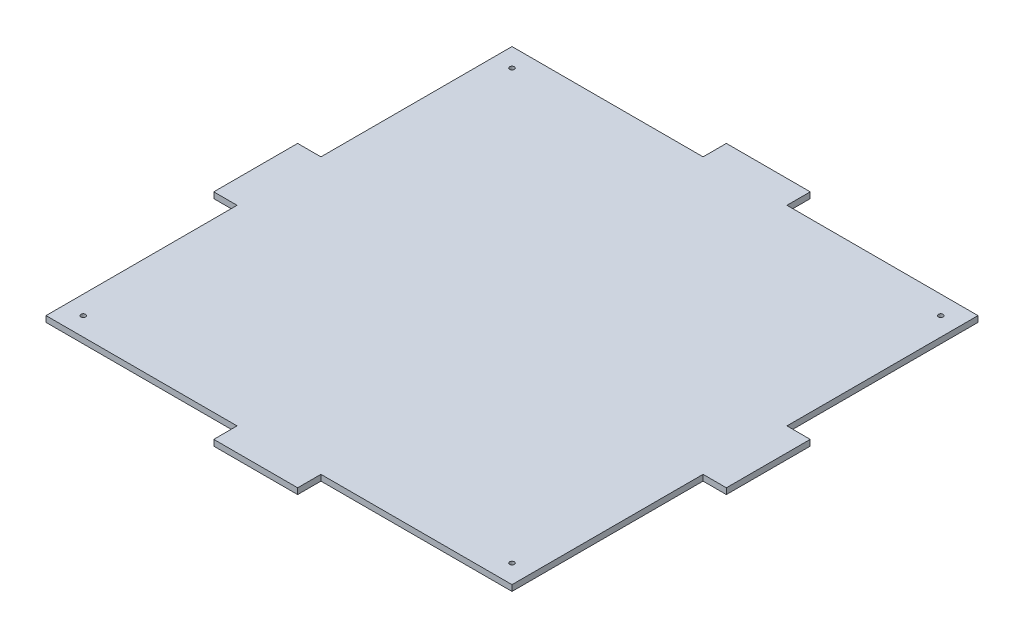
ISO-10303-21;
HEADER;
FILE_DESCRIPTION(('STEP AP214'),'2;1');
FILE_NAME('part.step','',(''),(''),'','','');
FILE_SCHEMA(('AUTOMOTIVE_DESIGN { 1 0 10303 214 1 1 1 1 }'));
ENDSEC;
DATA;
#1=APPLICATION_CONTEXT('core data for automotive mechanical design processes');
#2=APPLICATION_PROTOCOL_DEFINITION('international standard','automotive_design',2000,#1);
#3=PRODUCT_CONTEXT('',#1,'mechanical');
#4=PRODUCT('Part','Part','',(#3));
#5=PRODUCT_RELATED_PRODUCT_CATEGORY('part','',(#4));
#6=PRODUCT_DEFINITION_FORMATION('','',#4);
#7=PRODUCT_DEFINITION_CONTEXT('part definition',#1,'design');
#8=PRODUCT_DEFINITION('design','',#6,#7);
#9=PRODUCT_DEFINITION_SHAPE('','',#8);
#10=(LENGTH_UNIT() NAMED_UNIT(*) SI_UNIT(.MILLI.,.METRE.));
#11=(NAMED_UNIT(*) PLANE_ANGLE_UNIT() SI_UNIT($,.RADIAN.));
#12=(NAMED_UNIT(*) SI_UNIT($,.STERADIAN.) SOLID_ANGLE_UNIT());
#13=UNCERTAINTY_MEASURE_WITH_UNIT(LENGTH_MEASURE(1.E-05),#10,'distance_accuracy_value','');
#14=(GEOMETRIC_REPRESENTATION_CONTEXT(3) GLOBAL_UNCERTAINTY_ASSIGNED_CONTEXT((#13)) GLOBAL_UNIT_ASSIGNED_CONTEXT((#10,
#11,#12)) REPRESENTATION_CONTEXT('',''));
#15=CARTESIAN_POINT('',(0.,0.,0.));
#16=DIRECTION('',(0.,0.,1.));
#17=DIRECTION('',(1.,0.,0.));
#18=AXIS2_PLACEMENT_3D('',#15,#16,#17);
#19=CARTESIAN_POINT('',(0.,3.175,0.));
#20=DIRECTION('',(0.,-1.,0.));
#21=DIRECTION('',(0.,0.,-1.));
#22=AXIS2_PLACEMENT_3D('',#19,#20,#21);
#23=PLANE('',#22);
#24=CARTESIAN_POINT('',(115.,3.175,-115.));
#25=DIRECTION('',(0.,1.,0.));
#26=DIRECTION('',(0.,0.,1.));
#27=AXIS2_PLACEMENT_3D('',#24,#25,#26);
#28=CIRCLE('',#27,1.25000000000003);
#29=CARTESIAN_POINT('',(115.,3.175,-113.75));
#30=VERTEX_POINT('',#29);
#31=EDGE_CURVE('E325',#30,#30,#28,.F.);
#32=ORIENTED_EDGE('',*,*,#31,.T.);
#33=EDGE_LOOP('',(#32));
#34=FACE_BOUND('',#33,.T.);
#35=DIRECTION('',(0.,0.,-1.));
#36=VECTOR('',#35,1.);
#37=CARTESIAN_POINT('',(125.,3.175,125.));
#38=LINE('',#37,#36);
#39=CARTESIAN_POINT('',(125.,3.175,125.));
#40=VERTEX_POINT('',#39);
#41=CARTESIAN_POINT('',(125.,3.175,22.5));
#42=VERTEX_POINT('',#41);
#43=EDGE_CURVE('E289',#40,#42,#38,.T.);
#44=ORIENTED_EDGE('',*,*,#43,.T.);
#45=DIRECTION('',(-1.,0.,0.));
#46=VECTOR('',#45,1.);
#47=CARTESIAN_POINT('',(137.5,3.175,22.5));
#48=LINE('',#47,#46);
#49=CARTESIAN_POINT('',(137.5,3.175,22.5));
#50=VERTEX_POINT('',#49);
#51=EDGE_CURVE('E186',#50,#42,#48,.T.);
#52=ORIENTED_EDGE('',*,*,#51,.F.);
#53=DIRECTION('',(0.,0.,1.));
#54=VECTOR('',#53,1.);
#55=CARTESIAN_POINT('',(137.5,3.175,22.5));
#56=LINE('',#55,#54);
#57=CARTESIAN_POINT('',(137.5,3.175,-22.5));
#58=VERTEX_POINT('',#57);
#59=EDGE_CURVE('E179',#58,#50,#56,.T.);
#60=ORIENTED_EDGE('',*,*,#59,.F.);
#61=DIRECTION('',(-1.,0.,0.));
#62=VECTOR('',#61,1.);
#63=CARTESIAN_POINT('',(137.5,3.175,-22.5));
#64=LINE('',#63,#62);
#65=CARTESIAN_POINT('',(125.,3.175,-22.5));
#66=VERTEX_POINT('',#65);
#67=EDGE_CURVE('E183',#58,#66,#64,.T.);
#68=ORIENTED_EDGE('',*,*,#67,.T.);
#69=CARTESIAN_POINT('',(125.,3.175,-125.));
#70=VERTEX_POINT('',#69);
#71=EDGE_CURVE('E57',#66,#70,#38,.T.);
#72=ORIENTED_EDGE('',*,*,#71,.T.);
#73=DIRECTION('',(-1.,0.,0.));
#74=VECTOR('',#73,1.);
#75=CARTESIAN_POINT('',(-125.,3.175,-125.));
#76=LINE('',#75,#74);
#77=CARTESIAN_POINT('',(22.5,3.175,-125.));
#78=VERTEX_POINT('',#77);
#79=EDGE_CURVE('E292',#70,#78,#76,.T.);
#80=ORIENTED_EDGE('',*,*,#79,.T.);
#81=DIRECTION('',(0.,0.,1.));
#82=VECTOR('',#81,1.);
#83=CARTESIAN_POINT('',(22.5,3.175,-137.5));
#84=LINE('',#83,#82);
#85=CARTESIAN_POINT('',(22.5,3.175,-137.5));
#86=VERTEX_POINT('',#85);
#87=EDGE_CURVE('E282',#86,#78,#84,.T.);
#88=ORIENTED_EDGE('',*,*,#87,.F.);
#89=DIRECTION('',(1.,0.,0.));
#90=VECTOR('',#89,1.);
#91=CARTESIAN_POINT('',(22.5,3.175,-137.5));
#92=LINE('',#91,#90);
#93=CARTESIAN_POINT('',(-22.5,3.175,-137.5));
#94=VERTEX_POINT('',#93);
#95=EDGE_CURVE('E265',#94,#86,#92,.T.);
#96=ORIENTED_EDGE('',*,*,#95,.F.);
#97=DIRECTION('',(0.,0.,1.));
#98=VECTOR('',#97,1.);
#99=CARTESIAN_POINT('',(-22.5,3.175,-137.5));
#100=LINE('',#99,#98);
#101=CARTESIAN_POINT('',(-22.5,3.175,-125.));
#102=VERTEX_POINT('',#101);
#103=EDGE_CURVE('E285',#94,#102,#100,.T.);
#104=ORIENTED_EDGE('',*,*,#103,.T.);
#105=CARTESIAN_POINT('',(-125.,3.175,-125.));
#106=VERTEX_POINT('',#105);
#107=EDGE_CURVE('E291',#102,#106,#76,.T.);
#108=ORIENTED_EDGE('',*,*,#107,.T.);
#109=DIRECTION('',(0.,0.,1.));
#110=VECTOR('',#109,1.);
#111=CARTESIAN_POINT('',(-125.,3.175,125.));
#112=LINE('',#111,#110);
#113=CARTESIAN_POINT('',(-125.,3.175,-22.5));
#114=VERTEX_POINT('',#113);
#115=EDGE_CURVE('E296',#106,#114,#112,.T.);
#116=ORIENTED_EDGE('',*,*,#115,.T.);
#117=DIRECTION('',(1.,0.,0.));
#118=VECTOR('',#117,1.);
#119=CARTESIAN_POINT('',(-137.5,3.175,-22.5));
#120=LINE('',#119,#118);
#121=CARTESIAN_POINT('',(-137.5,3.175,-22.5));
#122=VERTEX_POINT('',#121);
#123=EDGE_CURVE('E255',#122,#114,#120,.T.);
#124=ORIENTED_EDGE('',*,*,#123,.F.);
#125=DIRECTION('',(0.,0.,-1.));
#126=VECTOR('',#125,1.);
#127=CARTESIAN_POINT('',(-137.5,3.175,-22.5));
#128=LINE('',#127,#126);
#129=CARTESIAN_POINT('',(-137.5,3.175,22.5));
#130=VERTEX_POINT('',#129);
#131=EDGE_CURVE('E238',#130,#122,#128,.T.);
#132=ORIENTED_EDGE('',*,*,#131,.F.);
#133=DIRECTION('',(1.,0.,0.));
#134=VECTOR('',#133,1.);
#135=CARTESIAN_POINT('',(-137.5,3.175,22.5));
#136=LINE('',#135,#134);
#137=CARTESIAN_POINT('',(-125.,3.175,22.5));
#138=VERTEX_POINT('',#137);
#139=EDGE_CURVE('E258',#130,#138,#136,.T.);
#140=ORIENTED_EDGE('',*,*,#139,.T.);
#141=CARTESIAN_POINT('',(-125.,3.175,125.));
#142=VERTEX_POINT('',#141);
#143=EDGE_CURVE('E295',#138,#142,#112,.T.);
#144=ORIENTED_EDGE('',*,*,#143,.T.);
#145=DIRECTION('',(1.,0.,0.));
#146=VECTOR('',#145,1.);
#147=CARTESIAN_POINT('',(-125.,3.175,125.));
#148=LINE('',#147,#146);
#149=CARTESIAN_POINT('',(-22.5,3.175,125.));
#150=VERTEX_POINT('',#149);
#151=EDGE_CURVE('E300',#142,#150,#148,.T.);
#152=ORIENTED_EDGE('',*,*,#151,.T.);
#153=DIRECTION('',(0.,0.,-1.));
#154=VECTOR('',#153,1.);
#155=CARTESIAN_POINT('',(-22.5,3.175,137.5));
#156=LINE('',#155,#154);
#157=CARTESIAN_POINT('',(-22.5,3.175,137.5));
#158=VERTEX_POINT('',#157);
#159=EDGE_CURVE('E228',#158,#150,#156,.T.);
#160=ORIENTED_EDGE('',*,*,#159,.F.);
#161=DIRECTION('',(-1.,0.,0.));
#162=VECTOR('',#161,1.);
#163=CARTESIAN_POINT('',(-22.5,3.175,137.5));
#164=LINE('',#163,#162);
#165=CARTESIAN_POINT('',(22.5,3.175,137.5));
#166=VERTEX_POINT('',#165);
#167=EDGE_CURVE('E214',#166,#158,#164,.T.);
#168=ORIENTED_EDGE('',*,*,#167,.F.);
#169=DIRECTION('',(0.,0.,-1.));
#170=VECTOR('',#169,1.);
#171=CARTESIAN_POINT('',(22.5,3.175,137.5));
#172=LINE('',#171,#170);
#173=CARTESIAN_POINT('',(22.5,3.175,125.));
#174=VERTEX_POINT('',#173);
#175=EDGE_CURVE('E231',#166,#174,#172,.T.);
#176=ORIENTED_EDGE('',*,*,#175,.T.);
#177=EDGE_CURVE('E299',#174,#40,#148,.T.);
#178=ORIENTED_EDGE('',*,*,#177,.T.);
#179=EDGE_LOOP('',(#44,#52,#60,#68,#72,#80,#88,#96,#104,#108,#116,#124,#132,#140,#144,#152,#160,
#168,#176,#178));
#180=FACE_BOUND('',#179,.T.);
#181=CARTESIAN_POINT('',(-115.,3.175,-115.));
#182=DIRECTION('',(0.,1.,0.));
#183=DIRECTION('',(0.,0.,1.));
#184=AXIS2_PLACEMENT_3D('',#181,#182,#183);
#185=CIRCLE('',#184,1.25);
#186=CARTESIAN_POINT('',(-115.,3.175,-113.75));
#187=VERTEX_POINT('',#186);
#188=EDGE_CURVE('E330',#187,#187,#185,.T.);
#189=ORIENTED_EDGE('',*,*,#188,.F.);
#190=EDGE_LOOP('',(#189));
#191=FACE_BOUND('',#190,.T.);
#192=CARTESIAN_POINT('',(-115.,3.175,115.));
#193=DIRECTION('',(0.,-1.,0.));
#194=DIRECTION('',(0.,0.,-1.));
#195=AXIS2_PLACEMENT_3D('',#192,#193,#194);
#196=CIRCLE('',#195,1.25);
#197=CARTESIAN_POINT('',(-115.,3.175,113.75));
#198=VERTEX_POINT('',#197);
#199=EDGE_CURVE('E341',#198,#198,#196,.T.);
#200=ORIENTED_EDGE('',*,*,#199,.T.);
#201=EDGE_LOOP('',(#200));
#202=FACE_BOUND('',#201,.T.);
#203=CARTESIAN_POINT('',(115.,3.175,115.));
#204=DIRECTION('',(0.,1.,0.));
#205=DIRECTION('',(0.,0.,1.));
#206=AXIS2_PLACEMENT_3D('',#203,#204,#205);
#207=CIRCLE('',#206,1.25000000000003);
#208=CARTESIAN_POINT('',(115.,3.175,116.25));
#209=VERTEX_POINT('',#208);
#210=EDGE_CURVE('E670',#209,#209,#207,.T.);
#211=ORIENTED_EDGE('',*,*,#210,.F.);
#212=EDGE_LOOP('',(#211));
#213=FACE_BOUND('',#212,.T.);
#214=ADVANCED_FACE('F40',(#34,#180,#191,#202,#213),#23,.F.);
#215=CARTESIAN_POINT('',(0.,0.,0.));
#216=DIRECTION('',(0.,-1.,0.));
#217=DIRECTION('',(0.,0.,-1.));
#218=AXIS2_PLACEMENT_3D('',#215,#216,#217);
#219=PLANE('',#218);
#220=CARTESIAN_POINT('',(115.,0.,-115.));
#221=DIRECTION('',(0.,-1.,0.));
#222=DIRECTION('',(0.,0.,-1.));
#223=AXIS2_PLACEMENT_3D('',#220,#221,#222);
#224=CIRCLE('',#223,1.25000000000003);
#225=CARTESIAN_POINT('',(115.,0.,-116.25));
#226=VERTEX_POINT('',#225);
#227=EDGE_CURVE('E44',#226,#226,#224,.F.);
#228=ORIENTED_EDGE('',*,*,#227,.T.);
#229=EDGE_LOOP('',(#228));
#230=FACE_BOUND('',#229,.T.);
#231=CARTESIAN_POINT('',(-115.,0.,115.));
#232=DIRECTION('',(0.,-1.,0.));
#233=DIRECTION('',(0.,0.,-1.));
#234=AXIS2_PLACEMENT_3D('',#231,#232,#233);
#235=CIRCLE('',#234,1.25);
#236=CARTESIAN_POINT('',(-115.,0.,113.75));
#237=VERTEX_POINT('',#236);
#238=EDGE_CURVE('E322',#237,#237,#235,.F.);
#239=ORIENTED_EDGE('',*,*,#238,.T.);
#240=EDGE_LOOP('',(#239));
#241=FACE_BOUND('',#240,.T.);
#242=CARTESIAN_POINT('',(-115.,0.,-115.));
#243=DIRECTION('',(0.,1.,0.));
#244=DIRECTION('',(0.,0.,1.));
#245=AXIS2_PLACEMENT_3D('',#242,#243,#244);
#246=CIRCLE('',#245,1.25);
#247=CARTESIAN_POINT('',(-115.,0.,-113.75));
#248=VERTEX_POINT('',#247);
#249=EDGE_CURVE('E334',#248,#248,#246,.T.);
#250=ORIENTED_EDGE('',*,*,#249,.T.);
#251=EDGE_LOOP('',(#250));
#252=FACE_BOUND('',#251,.T.);
#253=DIRECTION('',(0.,0.,-1.));
#254=VECTOR('',#253,1.);
#255=CARTESIAN_POINT('',(125.,0.,125.));
#256=LINE('',#255,#254);
#257=CARTESIAN_POINT('',(125.,0.,125.));
#258=VERTEX_POINT('',#257);
#259=CARTESIAN_POINT('',(125.,0.,22.5));
#260=VERTEX_POINT('',#259);
#261=EDGE_CURVE('E304',#258,#260,#256,.T.);
#262=ORIENTED_EDGE('',*,*,#261,.F.);
#263=DIRECTION('',(1.,0.,0.));
#264=VECTOR('',#263,1.);
#265=CARTESIAN_POINT('',(-125.,0.,125.));
#266=LINE('',#265,#264);
#267=CARTESIAN_POINT('',(22.5,0.,125.));
#268=VERTEX_POINT('',#267);
#269=EDGE_CURVE('E312',#268,#258,#266,.T.);
#270=ORIENTED_EDGE('',*,*,#269,.F.);
#271=DIRECTION('',(0.,0.,-1.));
#272=VECTOR('',#271,1.);
#273=CARTESIAN_POINT('',(22.5,0.,137.5));
#274=LINE('',#273,#272);
#275=CARTESIAN_POINT('',(22.5,0.,137.5));
#276=VERTEX_POINT('',#275);
#277=EDGE_CURVE('E219',#276,#268,#274,.T.);
#278=ORIENTED_EDGE('',*,*,#277,.F.);
#279=DIRECTION('',(1.,0.,0.));
#280=VECTOR('',#279,1.);
#281=CARTESIAN_POINT('',(-22.5,0.,137.5));
#282=LINE('',#281,#280);
#283=CARTESIAN_POINT('',(-22.5,0.,137.5));
#284=VERTEX_POINT('',#283);
#285=EDGE_CURVE('E218',#284,#276,#282,.T.);
#286=ORIENTED_EDGE('',*,*,#285,.F.);
#287=DIRECTION('',(0.,0.,-1.));
#288=VECTOR('',#287,1.);
#289=CARTESIAN_POINT('',(-22.5,0.,137.5));
#290=LINE('',#289,#288);
#291=CARTESIAN_POINT('',(-22.5,0.,125.));
#292=VERTEX_POINT('',#291);
#293=EDGE_CURVE('E225',#284,#292,#290,.T.);
#294=ORIENTED_EDGE('',*,*,#293,.T.);
#295=CARTESIAN_POINT('',(-125.,0.,125.));
#296=VERTEX_POINT('',#295);
#297=EDGE_CURVE('E313',#296,#292,#266,.T.);
#298=ORIENTED_EDGE('',*,*,#297,.F.);
#299=DIRECTION('',(0.,0.,1.));
#300=VECTOR('',#299,1.);
#301=CARTESIAN_POINT('',(-125.,0.,125.));
#302=LINE('',#301,#300);
#303=CARTESIAN_POINT('',(-125.,0.,22.5));
#304=VERTEX_POINT('',#303);
#305=EDGE_CURVE('E309',#304,#296,#302,.T.);
#306=ORIENTED_EDGE('',*,*,#305,.F.);
#307=DIRECTION('',(1.,0.,0.));
#308=VECTOR('',#307,1.);
#309=CARTESIAN_POINT('',(-137.5,0.,22.5));
#310=LINE('',#309,#308);
#311=CARTESIAN_POINT('',(-137.5,0.,22.5));
#312=VERTEX_POINT('',#311);
#313=EDGE_CURVE('E245',#312,#304,#310,.T.);
#314=ORIENTED_EDGE('',*,*,#313,.F.);
#315=DIRECTION('',(0.,0.,1.));
#316=VECTOR('',#315,1.);
#317=CARTESIAN_POINT('',(-137.5,0.,-22.5));
#318=LINE('',#317,#316);
#319=CARTESIAN_POINT('',(-137.5,0.,-22.5));
#320=VERTEX_POINT('',#319);
#321=EDGE_CURVE('E243',#320,#312,#318,.T.);
#322=ORIENTED_EDGE('',*,*,#321,.F.);
#323=DIRECTION('',(1.,0.,0.));
#324=VECTOR('',#323,1.);
#325=CARTESIAN_POINT('',(-137.5,0.,-22.5));
#326=LINE('',#325,#324);
#327=CARTESIAN_POINT('',(-125.,0.,-22.5));
#328=VERTEX_POINT('',#327);
#329=EDGE_CURVE('E252',#320,#328,#326,.T.);
#330=ORIENTED_EDGE('',*,*,#329,.T.);
#331=CARTESIAN_POINT('',(-125.,0.,-125.));
#332=VERTEX_POINT('',#331);
#333=EDGE_CURVE('E310',#332,#328,#302,.T.);
#334=ORIENTED_EDGE('',*,*,#333,.F.);
#335=DIRECTION('',(-1.,0.,0.));
#336=VECTOR('',#335,1.);
#337=CARTESIAN_POINT('',(-125.,0.,-125.));
#338=LINE('',#337,#336);
#339=CARTESIAN_POINT('',(-22.5,0.,-125.));
#340=VERTEX_POINT('',#339);
#341=EDGE_CURVE('E306',#340,#332,#338,.T.);
#342=ORIENTED_EDGE('',*,*,#341,.F.);
#343=DIRECTION('',(0.,0.,1.));
#344=VECTOR('',#343,1.);
#345=CARTESIAN_POINT('',(-22.5,0.,-137.5));
#346=LINE('',#345,#344);
#347=CARTESIAN_POINT('',(-22.5,0.,-137.5));
#348=VERTEX_POINT('',#347);
#349=EDGE_CURVE('E272',#348,#340,#346,.T.);
#350=ORIENTED_EDGE('',*,*,#349,.F.);
#351=DIRECTION('',(-1.,0.,0.));
#352=VECTOR('',#351,1.);
#353=CARTESIAN_POINT('',(22.5,0.,-137.5));
#354=LINE('',#353,#352);
#355=CARTESIAN_POINT('',(22.5,0.,-137.5));
#356=VERTEX_POINT('',#355);
#357=EDGE_CURVE('E270',#356,#348,#354,.T.);
#358=ORIENTED_EDGE('',*,*,#357,.F.);
#359=DIRECTION('',(0.,0.,1.));
#360=VECTOR('',#359,1.);
#361=CARTESIAN_POINT('',(22.5,0.,-137.5));
#362=LINE('',#361,#360);
#363=CARTESIAN_POINT('',(22.5,0.,-125.));
#364=VERTEX_POINT('',#363);
#365=EDGE_CURVE('E279',#356,#364,#362,.T.);
#366=ORIENTED_EDGE('',*,*,#365,.T.);
#367=CARTESIAN_POINT('',(125.,0.,-125.));
#368=VERTEX_POINT('',#367);
#369=EDGE_CURVE('E307',#368,#364,#338,.T.);
#370=ORIENTED_EDGE('',*,*,#369,.F.);
#371=CARTESIAN_POINT('',(125.,0.,-22.5));
#372=VERTEX_POINT('',#371);
#373=EDGE_CURVE('E288',#372,#368,#256,.T.);
#374=ORIENTED_EDGE('',*,*,#373,.F.);
#375=DIRECTION('',(-1.,0.,0.));
#376=VECTOR('',#375,1.);
#377=CARTESIAN_POINT('',(137.5,0.,-22.5));
#378=LINE('',#377,#376);
#379=CARTESIAN_POINT('',(137.5,0.,-22.5));
#380=VERTEX_POINT('',#379);
#381=EDGE_CURVE('E346',#380,#372,#378,.T.);
#382=ORIENTED_EDGE('',*,*,#381,.F.);
#383=DIRECTION('',(0.,0.,-1.));
#384=VECTOR('',#383,1.);
#385=CARTESIAN_POINT('',(137.5,0.,22.5));
#386=LINE('',#385,#384);
#387=CARTESIAN_POINT('',(137.5,0.,22.5));
#388=VERTEX_POINT('',#387);
#389=EDGE_CURVE('E195',#388,#380,#386,.T.);
#390=ORIENTED_EDGE('',*,*,#389,.F.);
#391=DIRECTION('',(-1.,0.,0.));
#392=VECTOR('',#391,1.);
#393=CARTESIAN_POINT('',(137.5,0.,22.5));
#394=LINE('',#393,#392);
#395=EDGE_CURVE('E207',#388,#260,#394,.T.);
#396=ORIENTED_EDGE('',*,*,#395,.T.);
#397=EDGE_LOOP('',(#262,#270,#278,#286,#294,#298,#306,#314,#322,#330,#334,#342,#350,#358,#366,
#370,#374,#382,#390,#396));
#398=FACE_BOUND('',#397,.T.);
#399=CARTESIAN_POINT('',(115.,0.,115.));
#400=DIRECTION('',(0.,-1.,0.));
#401=DIRECTION('',(0.,0.,-1.));
#402=AXIS2_PLACEMENT_3D('',#399,#400,#401);
#403=CIRCLE('',#402,1.25000000000003);
#404=CARTESIAN_POINT('',(115.,0.,113.75));
#405=VERTEX_POINT('',#404);
#406=EDGE_CURVE('E324',#405,#405,#403,.T.);
#407=ORIENTED_EDGE('',*,*,#406,.F.);
#408=EDGE_LOOP('',(#407));
#409=FACE_BOUND('',#408,.T.);
#410=ADVANCED_FACE('F353',(#230,#241,#252,#398,#409),#219,.T.);
#411=CARTESIAN_POINT('',(125.,3.175,125.));
#412=DIRECTION('',(-1.,0.,0.));
#413=DIRECTION('',(0.,0.,1.));
#414=AXIS2_PLACEMENT_3D('',#411,#412,#413);
#415=PLANE('',#414);
#416=DIRECTION('',(0.,1.,0.));
#417=VECTOR('',#416,1.);
#418=CARTESIAN_POINT('',(125.,0.,-22.5));
#419=LINE('',#418,#417);
#420=EDGE_CURVE('E201',#372,#66,#419,.T.);
#421=ORIENTED_EDGE('',*,*,#420,.F.);
#422=ORIENTED_EDGE('',*,*,#373,.T.);
#423=DIRECTION('',(0.,-1.,0.));
#424=VECTOR('',#423,1.);
#425=CARTESIAN_POINT('',(125.,3.175,-125.));
#426=LINE('',#425,#424);
#427=EDGE_CURVE('E11',#70,#368,#426,.T.);
#428=ORIENTED_EDGE('',*,*,#427,.F.);
#429=ORIENTED_EDGE('',*,*,#71,.F.);
#430=EDGE_LOOP('',(#421,#422,#428,#429));
#431=FACE_BOUND('',#430,.T.);
#432=ADVANCED_FACE('F42',(#431),#415,.F.);
#433=DIRECTION('',(0.,-1.,0.));
#434=VECTOR('',#433,1.);
#435=CARTESIAN_POINT('',(125.,0.,22.5));
#436=LINE('',#435,#434);
#437=EDGE_CURVE('E65',#42,#260,#436,.T.);
#438=ORIENTED_EDGE('',*,*,#437,.F.);
#439=ORIENTED_EDGE('',*,*,#43,.F.);
#440=DIRECTION('',(0.,-1.,0.));
#441=VECTOR('',#440,1.);
#442=CARTESIAN_POINT('',(125.,3.175,125.));
#443=LINE('',#442,#441);
#444=EDGE_CURVE('E303',#40,#258,#443,.T.);
#445=ORIENTED_EDGE('',*,*,#444,.T.);
#446=ORIENTED_EDGE('',*,*,#261,.T.);
#447=EDGE_LOOP('',(#438,#439,#445,#446));
#448=FACE_BOUND('',#447,.T.);
#449=ADVANCED_FACE('F384',(#448),#415,.F.);
#450=CARTESIAN_POINT('',(-125.,3.175,125.));
#451=DIRECTION('',(0.,0.,-1.));
#452=DIRECTION('',(-1.,0.,0.));
#453=AXIS2_PLACEMENT_3D('',#450,#451,#452);
#454=PLANE('',#453);
#455=DIRECTION('',(0.,1.,0.));
#456=VECTOR('',#455,1.);
#457=CARTESIAN_POINT('',(22.5,0.,125.));
#458=LINE('',#457,#456);
#459=EDGE_CURVE('E202',#268,#174,#458,.T.);
#460=ORIENTED_EDGE('',*,*,#459,.F.);
#461=ORIENTED_EDGE('',*,*,#269,.T.);
#462=ORIENTED_EDGE('',*,*,#444,.F.);
#463=ORIENTED_EDGE('',*,*,#177,.F.);
#464=EDGE_LOOP('',(#460,#461,#462,#463));
#465=FACE_BOUND('',#464,.T.);
#466=ADVANCED_FACE('F380',(#465),#454,.F.);
#467=DIRECTION('',(0.,-1.,0.));
#468=VECTOR('',#467,1.);
#469=CARTESIAN_POINT('',(-22.5,0.,125.));
#470=LINE('',#469,#468);
#471=EDGE_CURVE('E205',#150,#292,#470,.T.);
#472=ORIENTED_EDGE('',*,*,#471,.F.);
#473=ORIENTED_EDGE('',*,*,#151,.F.);
#474=DIRECTION('',(0.,-1.,0.));
#475=VECTOR('',#474,1.);
#476=CARTESIAN_POINT('',(-125.,3.175,125.));
#477=LINE('',#476,#475);
#478=EDGE_CURVE('E317',#142,#296,#477,.T.);
#479=ORIENTED_EDGE('',*,*,#478,.T.);
#480=ORIENTED_EDGE('',*,*,#297,.T.);
#481=EDGE_LOOP('',(#472,#473,#479,#480));
#482=FACE_BOUND('',#481,.T.);
#483=ADVANCED_FACE('F383',(#482),#454,.F.);
#484=CARTESIAN_POINT('',(-125.,3.175,125.));
#485=DIRECTION('',(1.,0.,0.));
#486=DIRECTION('',(0.,0.,-1.));
#487=AXIS2_PLACEMENT_3D('',#484,#485,#486);
#488=PLANE('',#487);
#489=DIRECTION('',(0.,1.,0.));
#490=VECTOR('',#489,1.);
#491=CARTESIAN_POINT('',(-125.,0.,22.5));
#492=LINE('',#491,#490);
#493=EDGE_CURVE('E234',#304,#138,#492,.T.);
#494=ORIENTED_EDGE('',*,*,#493,.F.);
#495=ORIENTED_EDGE('',*,*,#305,.T.);
#496=ORIENTED_EDGE('',*,*,#478,.F.);
#497=ORIENTED_EDGE('',*,*,#143,.F.);
#498=EDGE_LOOP('',(#494,#495,#496,#497));
#499=FACE_BOUND('',#498,.T.);
#500=ADVANCED_FACE('F386',(#499),#488,.F.);
#501=DIRECTION('',(0.,-1.,0.));
#502=VECTOR('',#501,1.);
#503=CARTESIAN_POINT('',(-125.,0.,-22.5));
#504=LINE('',#503,#502);
#505=EDGE_CURVE('E239',#114,#328,#504,.T.);
#506=ORIENTED_EDGE('',*,*,#505,.F.);
#507=ORIENTED_EDGE('',*,*,#115,.F.);
#508=DIRECTION('',(0.,-1.,0.));
#509=VECTOR('',#508,1.);
#510=CARTESIAN_POINT('',(-125.,3.175,-125.));
#511=LINE('',#510,#509);
#512=EDGE_CURVE('E49',#106,#332,#511,.T.);
#513=ORIENTED_EDGE('',*,*,#512,.T.);
#514=ORIENTED_EDGE('',*,*,#333,.T.);
#515=EDGE_LOOP('',(#506,#507,#513,#514));
#516=FACE_BOUND('',#515,.T.);
#517=ADVANCED_FACE('F388',(#516),#488,.F.);
#518=CARTESIAN_POINT('',(-125.,3.175,-125.));
#519=DIRECTION('',(0.,0.,1.));
#520=DIRECTION('',(1.,0.,0.));
#521=AXIS2_PLACEMENT_3D('',#518,#519,#520);
#522=PLANE('',#521);
#523=DIRECTION('',(0.,1.,0.));
#524=VECTOR('',#523,1.);
#525=CARTESIAN_POINT('',(-22.5,0.,-125.));
#526=LINE('',#525,#524);
#527=EDGE_CURVE('E261',#340,#102,#526,.T.);
#528=ORIENTED_EDGE('',*,*,#527,.F.);
#529=ORIENTED_EDGE('',*,*,#341,.T.);
#530=ORIENTED_EDGE('',*,*,#512,.F.);
#531=ORIENTED_EDGE('',*,*,#107,.F.);
#532=EDGE_LOOP('',(#528,#529,#530,#531));
#533=FACE_BOUND('',#532,.T.);
#534=ADVANCED_FACE('F390',(#533),#522,.F.);
#535=DIRECTION('',(0.,-1.,0.));
#536=VECTOR('',#535,1.);
#537=CARTESIAN_POINT('',(22.5,0.,-125.));
#538=LINE('',#537,#536);
#539=EDGE_CURVE('E266',#78,#364,#538,.T.);
#540=ORIENTED_EDGE('',*,*,#539,.F.);
#541=ORIENTED_EDGE('',*,*,#79,.F.);
#542=ORIENTED_EDGE('',*,*,#427,.T.);
#543=ORIENTED_EDGE('',*,*,#369,.T.);
#544=EDGE_LOOP('',(#540,#541,#542,#543));
#545=FACE_BOUND('',#544,.T.);
#546=ADVANCED_FACE('F392',(#545),#522,.F.);
#547=CARTESIAN_POINT('',(-22.5,0.,-137.5));
#548=DIRECTION('',(1.,0.,0.));
#549=DIRECTION('',(0.,0.,-1.));
#550=AXIS2_PLACEMENT_3D('',#547,#548,#549);
#551=PLANE('',#550);
#552=ORIENTED_EDGE('',*,*,#527,.T.);
#553=ORIENTED_EDGE('',*,*,#103,.F.);
#554=DIRECTION('',(0.,1.,0.));
#555=VECTOR('',#554,1.);
#556=CARTESIAN_POINT('',(-22.5,0.,-137.5));
#557=LINE('',#556,#555);
#558=EDGE_CURVE('E262',#348,#94,#557,.T.);
#559=ORIENTED_EDGE('',*,*,#558,.F.);
#560=ORIENTED_EDGE('',*,*,#349,.T.);
#561=EDGE_LOOP('',(#552,#553,#559,#560));
#562=FACE_BOUND('',#561,.T.);
#563=ADVANCED_FACE('F377',(#562),#551,.F.);
#564=CARTESIAN_POINT('',(22.5,0.,-137.5));
#565=DIRECTION('',(-1.,0.,0.));
#566=DIRECTION('',(0.,0.,1.));
#567=AXIS2_PLACEMENT_3D('',#564,#565,#566);
#568=PLANE('',#567);
#569=ORIENTED_EDGE('',*,*,#539,.T.);
#570=ORIENTED_EDGE('',*,*,#365,.F.);
#571=DIRECTION('',(0.,-1.,0.));
#572=VECTOR('',#571,1.);
#573=CARTESIAN_POINT('',(22.5,0.,-137.5));
#574=LINE('',#573,#572);
#575=EDGE_CURVE('E268',#86,#356,#574,.T.);
#576=ORIENTED_EDGE('',*,*,#575,.F.);
#577=ORIENTED_EDGE('',*,*,#87,.T.);
#578=EDGE_LOOP('',(#569,#570,#576,#577));
#579=FACE_BOUND('',#578,.T.);
#580=ADVANCED_FACE('F416',(#579),#568,.F.);
#581=CARTESIAN_POINT('',(0.,0.,-137.5));
#582=DIRECTION('',(0.,0.,1.));
#583=DIRECTION('',(1.,0.,0.));
#584=AXIS2_PLACEMENT_3D('',#581,#582,#583);
#585=PLANE('',#584);
#586=ORIENTED_EDGE('',*,*,#558,.T.);
#587=ORIENTED_EDGE('',*,*,#95,.T.);
#588=ORIENTED_EDGE('',*,*,#575,.T.);
#589=ORIENTED_EDGE('',*,*,#357,.T.);
#590=EDGE_LOOP('',(#586,#587,#588,#589));
#591=FACE_BOUND('',#590,.T.);
#592=ADVANCED_FACE('F409',(#591),#585,.F.);
#593=CARTESIAN_POINT('',(-137.5,0.,22.5));
#594=DIRECTION('',(0.,0.,-1.));
#595=DIRECTION('',(-1.,0.,0.));
#596=AXIS2_PLACEMENT_3D('',#593,#594,#595);
#597=PLANE('',#596);
#598=ORIENTED_EDGE('',*,*,#493,.T.);
#599=ORIENTED_EDGE('',*,*,#139,.F.);
#600=DIRECTION('',(0.,1.,0.));
#601=VECTOR('',#600,1.);
#602=CARTESIAN_POINT('',(-137.5,0.,22.5));
#603=LINE('',#602,#601);
#604=EDGE_CURVE('E235',#312,#130,#603,.T.);
#605=ORIENTED_EDGE('',*,*,#604,.F.);
#606=ORIENTED_EDGE('',*,*,#313,.T.);
#607=EDGE_LOOP('',(#598,#599,#605,#606));
#608=FACE_BOUND('',#607,.T.);
#609=ADVANCED_FACE('F433',(#608),#597,.F.);
#610=CARTESIAN_POINT('',(-137.5,0.,-22.5));
#611=DIRECTION('',(0.,0.,1.));
#612=DIRECTION('',(1.,0.,0.));
#613=AXIS2_PLACEMENT_3D('',#610,#611,#612);
#614=PLANE('',#613);
#615=ORIENTED_EDGE('',*,*,#505,.T.);
#616=ORIENTED_EDGE('',*,*,#329,.F.);
#617=DIRECTION('',(0.,-1.,0.));
#618=VECTOR('',#617,1.);
#619=CARTESIAN_POINT('',(-137.5,0.,-22.5));
#620=LINE('',#619,#618);
#621=EDGE_CURVE('E241',#122,#320,#620,.T.);
#622=ORIENTED_EDGE('',*,*,#621,.F.);
#623=ORIENTED_EDGE('',*,*,#123,.T.);
#624=EDGE_LOOP('',(#615,#616,#622,#623));
#625=FACE_BOUND('',#624,.T.);
#626=ADVANCED_FACE('F422',(#625),#614,.F.);
#627=CARTESIAN_POINT('',(-137.5,0.,0.));
#628=DIRECTION('',(1.,0.,0.));
#629=DIRECTION('',(0.,0.,-1.));
#630=AXIS2_PLACEMENT_3D('',#627,#628,#629);
#631=PLANE('',#630);
#632=ORIENTED_EDGE('',*,*,#604,.T.);
#633=ORIENTED_EDGE('',*,*,#131,.T.);
#634=ORIENTED_EDGE('',*,*,#621,.T.);
#635=ORIENTED_EDGE('',*,*,#321,.T.);
#636=EDGE_LOOP('',(#632,#633,#634,#635));
#637=FACE_BOUND('',#636,.T.);
#638=ADVANCED_FACE('F429',(#637),#631,.F.);
#639=CARTESIAN_POINT('',(22.5,0.,137.5));
#640=DIRECTION('',(-1.,0.,0.));
#641=DIRECTION('',(0.,0.,1.));
#642=AXIS2_PLACEMENT_3D('',#639,#640,#641);
#643=PLANE('',#642);
#644=ORIENTED_EDGE('',*,*,#459,.T.);
#645=ORIENTED_EDGE('',*,*,#175,.F.);
#646=DIRECTION('',(0.,1.,0.));
#647=VECTOR('',#646,1.);
#648=CARTESIAN_POINT('',(22.5,0.,137.5));
#649=LINE('',#648,#647);
#650=EDGE_CURVE('E211',#276,#166,#649,.T.);
#651=ORIENTED_EDGE('',*,*,#650,.F.);
#652=ORIENTED_EDGE('',*,*,#277,.T.);
#653=EDGE_LOOP('',(#644,#645,#651,#652));
#654=FACE_BOUND('',#653,.T.);
#655=ADVANCED_FACE('F448',(#654),#643,.F.);
#656=CARTESIAN_POINT('',(-22.5,0.,137.5));
#657=DIRECTION('',(1.,0.,0.));
#658=DIRECTION('',(0.,0.,-1.));
#659=AXIS2_PLACEMENT_3D('',#656,#657,#658);
#660=PLANE('',#659);
#661=ORIENTED_EDGE('',*,*,#471,.T.);
#662=ORIENTED_EDGE('',*,*,#293,.F.);
#663=DIRECTION('',(0.,-1.,0.));
#664=VECTOR('',#663,1.);
#665=CARTESIAN_POINT('',(-22.5,0.,137.5));
#666=LINE('',#665,#664);
#667=EDGE_CURVE('E216',#158,#284,#666,.T.);
#668=ORIENTED_EDGE('',*,*,#667,.F.);
#669=ORIENTED_EDGE('',*,*,#159,.T.);
#670=EDGE_LOOP('',(#661,#662,#668,#669));
#671=FACE_BOUND('',#670,.T.);
#672=ADVANCED_FACE('F440',(#671),#660,.F.);
#673=CARTESIAN_POINT('',(0.,0.,137.5));
#674=DIRECTION('',(0.,0.,-1.));
#675=DIRECTION('',(-1.,0.,0.));
#676=AXIS2_PLACEMENT_3D('',#673,#674,#675);
#677=PLANE('',#676);
#678=ORIENTED_EDGE('',*,*,#650,.T.);
#679=ORIENTED_EDGE('',*,*,#167,.T.);
#680=ORIENTED_EDGE('',*,*,#667,.T.);
#681=ORIENTED_EDGE('',*,*,#285,.T.);
#682=EDGE_LOOP('',(#678,#679,#680,#681));
#683=FACE_BOUND('',#682,.T.);
#684=ADVANCED_FACE('F366',(#683),#677,.F.);
#685=CARTESIAN_POINT('',(137.5,0.,-22.5));
#686=DIRECTION('',(0.,0.,1.));
#687=DIRECTION('',(1.,0.,0.));
#688=AXIS2_PLACEMENT_3D('',#685,#686,#687);
#689=PLANE('',#688);
#690=ORIENTED_EDGE('',*,*,#420,.T.);
#691=ORIENTED_EDGE('',*,*,#67,.F.);
#692=DIRECTION('',(0.,1.,0.));
#693=VECTOR('',#692,1.);
#694=CARTESIAN_POINT('',(137.5,0.,-22.5));
#695=LINE('',#694,#693);
#696=EDGE_CURVE('E190',#380,#58,#695,.T.);
#697=ORIENTED_EDGE('',*,*,#696,.F.);
#698=ORIENTED_EDGE('',*,*,#381,.T.);
#699=EDGE_LOOP('',(#690,#691,#697,#698));
#700=FACE_BOUND('',#699,.T.);
#701=ADVANCED_FACE('F200',(#700),#689,.F.);
#702=CARTESIAN_POINT('',(137.5,0.,22.5));
#703=DIRECTION('',(0.,0.,-1.));
#704=DIRECTION('',(-1.,0.,0.));
#705=AXIS2_PLACEMENT_3D('',#702,#703,#704);
#706=PLANE('',#705);
#707=ORIENTED_EDGE('',*,*,#437,.T.);
#708=ORIENTED_EDGE('',*,*,#395,.F.);
#709=DIRECTION('',(0.,-1.,0.));
#710=VECTOR('',#709,1.);
#711=CARTESIAN_POINT('',(137.5,0.,22.5));
#712=LINE('',#711,#710);
#713=EDGE_CURVE('E189',#50,#388,#712,.T.);
#714=ORIENTED_EDGE('',*,*,#713,.F.);
#715=ORIENTED_EDGE('',*,*,#51,.T.);
#716=EDGE_LOOP('',(#707,#708,#714,#715));
#717=FACE_BOUND('',#716,.T.);
#718=ADVANCED_FACE('F357',(#717),#706,.F.);
#719=CARTESIAN_POINT('',(137.5,0.,0.));
#720=DIRECTION('',(-1.,0.,0.));
#721=DIRECTION('',(0.,0.,1.));
#722=AXIS2_PLACEMENT_3D('',#719,#720,#721);
#723=PLANE('',#722);
#724=ORIENTED_EDGE('',*,*,#696,.T.);
#725=ORIENTED_EDGE('',*,*,#59,.T.);
#726=ORIENTED_EDGE('',*,*,#713,.T.);
#727=ORIENTED_EDGE('',*,*,#389,.T.);
#728=EDGE_LOOP('',(#724,#725,#726,#727));
#729=FACE_BOUND('',#728,.T.);
#730=ADVANCED_FACE('F193',(#729),#723,.F.);
#731=CARTESIAN_POINT('',(-115.,3.175,-115.));
#732=DIRECTION('',(0.,1.,0.));
#733=DIRECTION('',(0.,0.,1.));
#734=AXIS2_PLACEMENT_3D('',#731,#732,#733);
#735=CYLINDRICAL_SURFACE('',#734,1.25);
#736=ORIENTED_EDGE('',*,*,#249,.F.);
#737=EDGE_LOOP('',(#736));
#738=FACE_BOUND('',#737,.T.);
#739=ORIENTED_EDGE('',*,*,#188,.T.);
#740=EDGE_LOOP('',(#739));
#741=FACE_BOUND('',#740,.T.);
#742=ADVANCED_FACE('F364',(#738,#741),#735,.F.);
#743=CARTESIAN_POINT('',(-115.,-6.825,115.));
#744=DIRECTION('',(0.,1.,0.));
#745=DIRECTION('',(0.,0.,1.));
#746=AXIS2_PLACEMENT_3D('',#743,#744,#745);
#747=CYLINDRICAL_SURFACE('',#746,1.25);
#748=ORIENTED_EDGE('',*,*,#238,.F.);
#749=EDGE_LOOP('',(#748));
#750=FACE_BOUND('',#749,.T.);
#751=ORIENTED_EDGE('',*,*,#199,.F.);
#752=EDGE_LOOP('',(#751));
#753=FACE_BOUND('',#752,.T.);
#754=ADVANCED_FACE('F472',(#750,#753),#747,.F.);
#755=CARTESIAN_POINT('',(115.,-6.825,115.));
#756=DIRECTION('',(0.,1.,0.));
#757=DIRECTION('',(0.,0.,1.));
#758=AXIS2_PLACEMENT_3D('',#755,#756,#757);
#759=CYLINDRICAL_SURFACE('',#758,1.25000000000003);
#760=ORIENTED_EDGE('',*,*,#406,.T.);
#761=EDGE_LOOP('',(#760));
#762=FACE_BOUND('',#761,.T.);
#763=ORIENTED_EDGE('',*,*,#210,.T.);
#764=EDGE_LOOP('',(#763));
#765=FACE_BOUND('',#764,.T.);
#766=ADVANCED_FACE('F477',(#762,#765),#759,.F.);
#767=CARTESIAN_POINT('',(115.,-6.825,-115.));
#768=DIRECTION('',(0.,1.,0.));
#769=DIRECTION('',(0.,0.,1.));
#770=AXIS2_PLACEMENT_3D('',#767,#768,#769);
#771=CYLINDRICAL_SURFACE('',#770,1.25000000000003);
#772=ORIENTED_EDGE('',*,*,#227,.F.);
#773=EDGE_LOOP('',(#772));
#774=FACE_BOUND('',#773,.T.);
#775=ORIENTED_EDGE('',*,*,#31,.F.);
#776=EDGE_LOOP('',(#775));
#777=FACE_BOUND('',#776,.T.);
#778=ADVANCED_FACE('F488',(#774,#777),#771,.F.);
#779=CLOSED_SHELL('',(#214,#410,#432,#449,#466,#483,#500,#517,#534,#546,#563,#580,#592,#609,
#626,#638,#655,#672,#684,#701,#718,#730,#742,#754,#766,#778));
#780=MANIFOLD_SOLID_BREP('B2',#779);
#781=ADVANCED_BREP_SHAPE_REPRESENTATION('',(#18,#780),#14);
#782=SHAPE_DEFINITION_REPRESENTATION(#9,#781);
ENDSEC;
END-ISO-10303-21;
